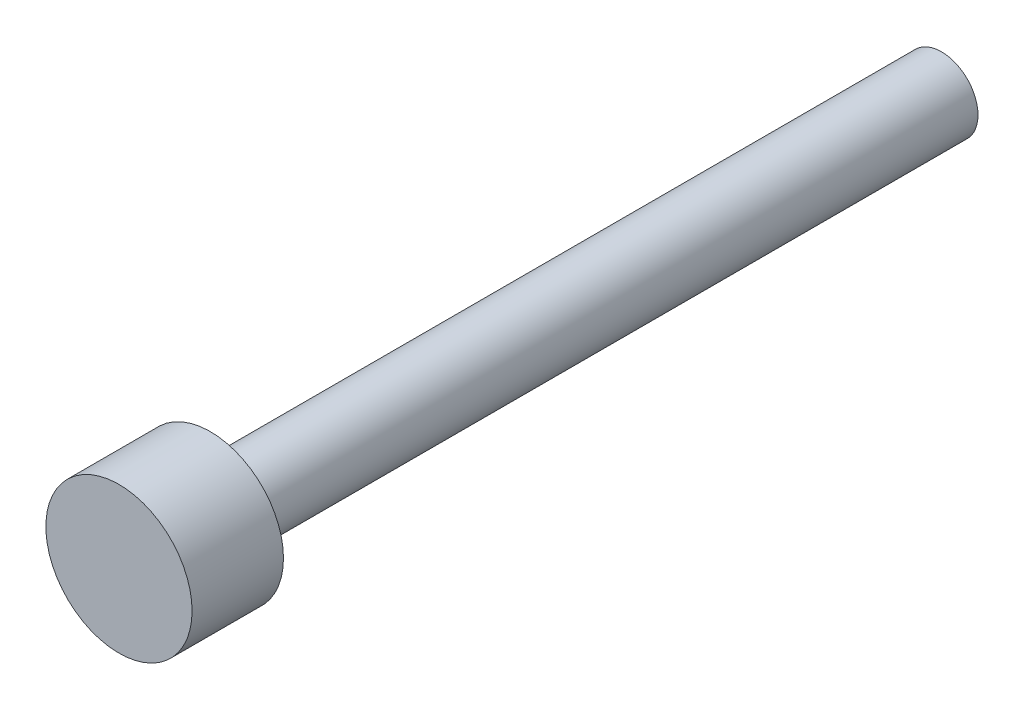
ISO-10303-21;
HEADER;
FILE_DESCRIPTION(('STEP AP214'),'2;1');
FILE_NAME('part.step','',(''),(''),'','','');
FILE_SCHEMA(('AUTOMOTIVE_DESIGN { 1 0 10303 214 1 1 1 1 }'));
ENDSEC;
DATA;
#1=APPLICATION_CONTEXT('core data for automotive mechanical design processes');
#2=APPLICATION_PROTOCOL_DEFINITION('international standard','automotive_design',2000,#1);
#3=PRODUCT_CONTEXT('',#1,'mechanical');
#4=PRODUCT('Part','Part','',(#3));
#5=PRODUCT_RELATED_PRODUCT_CATEGORY('part','',(#4));
#6=PRODUCT_DEFINITION_FORMATION('','',#4);
#7=PRODUCT_DEFINITION_CONTEXT('part definition',#1,'design');
#8=PRODUCT_DEFINITION('design','',#6,#7);
#9=PRODUCT_DEFINITION_SHAPE('','',#8);
#10=(LENGTH_UNIT() NAMED_UNIT(*) SI_UNIT(.MILLI.,.METRE.));
#11=(NAMED_UNIT(*) PLANE_ANGLE_UNIT() SI_UNIT($,.RADIAN.));
#12=(NAMED_UNIT(*) SI_UNIT($,.STERADIAN.) SOLID_ANGLE_UNIT());
#13=UNCERTAINTY_MEASURE_WITH_UNIT(LENGTH_MEASURE(1.E-05),#10,'distance_accuracy_value','');
#14=(GEOMETRIC_REPRESENTATION_CONTEXT(3) GLOBAL_UNCERTAINTY_ASSIGNED_CONTEXT((#13)) GLOBAL_UNIT_ASSIGNED_CONTEXT((#10,
#11,#12)) REPRESENTATION_CONTEXT('',''));
#15=CARTESIAN_POINT('',(0.,0.,0.));
#16=DIRECTION('',(0.,0.,1.));
#17=DIRECTION('',(1.,0.,0.));
#18=AXIS2_PLACEMENT_3D('',#15,#16,#17);
#19=CARTESIAN_POINT('',(0.,0.,5.));
#20=DIRECTION('',(0.,0.,-1.));
#21=DIRECTION('',(-1.,0.,0.));
#22=AXIS2_PLACEMENT_3D('',#19,#20,#21);
#23=CYLINDRICAL_SURFACE('',#22,4.);
#24=CARTESIAN_POINT('',(0.,0.,5.));
#25=DIRECTION('',(0.,0.,1.));
#26=DIRECTION('',(1.,0.,0.));
#27=AXIS2_PLACEMENT_3D('',#24,#25,#26);
#28=CIRCLE('',#27,4.);
#29=CARTESIAN_POINT('',(4.,0.,5.));
#30=VERTEX_POINT('',#29);
#31=EDGE_CURVE('E10',#30,#30,#28,.T.);
#32=ORIENTED_EDGE('',*,*,#31,.F.);
#33=EDGE_LOOP('',(#32));
#34=FACE_BOUND('',#33,.T.);
#35=CARTESIAN_POINT('',(0.,0.,0.));
#36=DIRECTION('',(0.,0.,1.));
#37=DIRECTION('',(1.,0.,0.));
#38=AXIS2_PLACEMENT_3D('',#35,#36,#37);
#39=CIRCLE('',#38,4.);
#40=CARTESIAN_POINT('',(4.,0.,0.));
#41=VERTEX_POINT('',#40);
#42=EDGE_CURVE('E40',#41,#41,#39,.T.);
#43=ORIENTED_EDGE('',*,*,#42,.T.);
#44=EDGE_LOOP('',(#43));
#45=FACE_BOUND('',#44,.T.);
#46=ADVANCED_FACE('F37',(#34,#45),#23,.T.);
#47=CARTESIAN_POINT('',(0.,0.,5.));
#48=DIRECTION('',(0.,0.,1.));
#49=DIRECTION('',(1.,0.,0.));
#50=AXIS2_PLACEMENT_3D('',#47,#48,#49);
#51=PLANE('',#50);
#52=ORIENTED_EDGE('',*,*,#31,.T.);
#53=EDGE_LOOP('',(#52));
#54=FACE_BOUND('',#53,.T.);
#55=ADVANCED_FACE('F71',(#54),#51,.T.);
#56=CARTESIAN_POINT('',(0.,0.,0.));
#57=DIRECTION('',(0.,0.,1.));
#58=DIRECTION('',(1.,0.,0.));
#59=AXIS2_PLACEMENT_3D('',#56,#57,#58);
#60=PLANE('',#59);
#61=CARTESIAN_POINT('',(0.,0.,0.));
#62=DIRECTION('',(0.,0.,1.));
#63=DIRECTION('',(1.,0.,0.));
#64=AXIS2_PLACEMENT_3D('',#61,#62,#63);
#65=CIRCLE('',#64,2.);
#66=CARTESIAN_POINT('',(2.,0.,0.));
#67=VERTEX_POINT('',#66);
#68=EDGE_CURVE('E51',#67,#67,#65,.T.);
#69=ORIENTED_EDGE('',*,*,#68,.T.);
#70=EDGE_LOOP('',(#69));
#71=FACE_BOUND('',#70,.T.);
#72=ORIENTED_EDGE('',*,*,#42,.F.);
#73=EDGE_LOOP('',(#72));
#74=FACE_BOUND('',#73,.T.);
#75=ADVANCED_FACE('F68',(#71,#74),#60,.F.);
#76=CARTESIAN_POINT('',(0.,0.,-40.));
#77=DIRECTION('',(0.,0.,1.));
#78=DIRECTION('',(1.,0.,0.));
#79=AXIS2_PLACEMENT_3D('',#76,#77,#78);
#80=CYLINDRICAL_SURFACE('',#79,2.);
#81=CARTESIAN_POINT('',(0.,0.,-40.));
#82=DIRECTION('',(0.,0.,1.));
#83=DIRECTION('',(1.,0.,0.));
#84=AXIS2_PLACEMENT_3D('',#81,#82,#83);
#85=CIRCLE('',#84,2.);
#86=CARTESIAN_POINT('',(2.,0.,-40.));
#87=VERTEX_POINT('',#86);
#88=EDGE_CURVE('E49',#87,#87,#85,.T.);
#89=ORIENTED_EDGE('',*,*,#88,.T.);
#90=EDGE_LOOP('',(#89));
#91=FACE_BOUND('',#90,.T.);
#92=ORIENTED_EDGE('',*,*,#68,.F.);
#93=EDGE_LOOP('',(#92));
#94=FACE_BOUND('',#93,.T.);
#95=ADVANCED_FACE('F59',(#91,#94),#80,.T.);
#96=CARTESIAN_POINT('',(0.,0.,-40.));
#97=DIRECTION('',(0.,0.,1.));
#98=DIRECTION('',(1.,0.,0.));
#99=AXIS2_PLACEMENT_3D('',#96,#97,#98);
#100=PLANE('',#99);
#101=ORIENTED_EDGE('',*,*,#88,.F.);
#102=EDGE_LOOP('',(#101));
#103=FACE_BOUND('',#102,.T.);
#104=ADVANCED_FACE('F62',(#103),#100,.F.);
#105=CLOSED_SHELL('',(#46,#55,#75,#95,#104));
#106=MANIFOLD_SOLID_BREP('B2',#105);
#107=ADVANCED_BREP_SHAPE_REPRESENTATION('',(#18,#106),#14);
#108=SHAPE_DEFINITION_REPRESENTATION(#9,#107);
ENDSEC;
END-ISO-10303-21;
